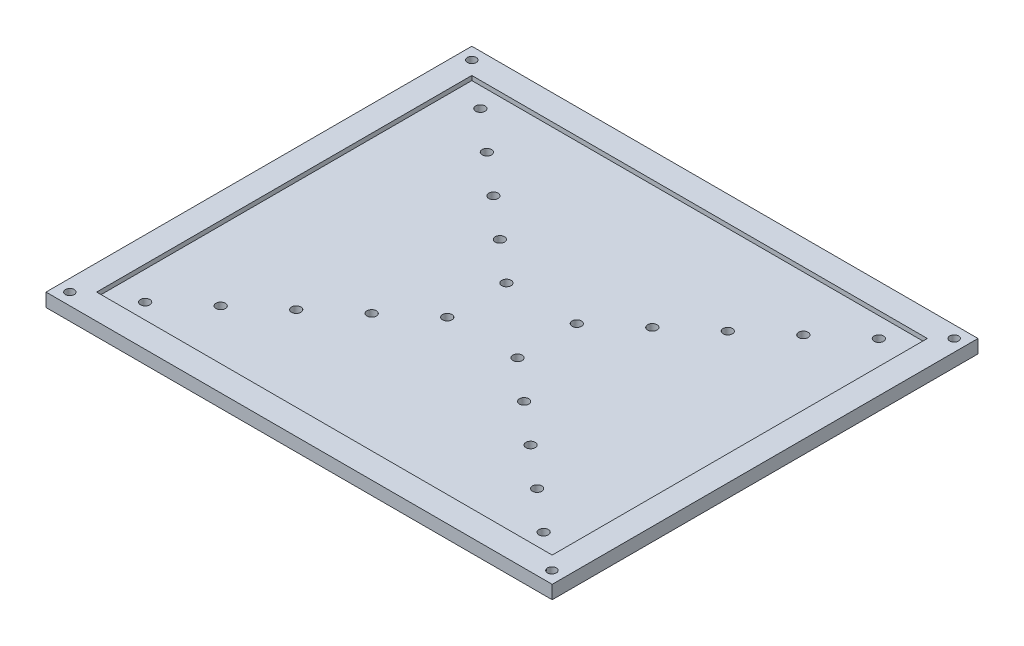
ISO-10303-21;
HEADER;
FILE_DESCRIPTION(('STEP AP214'),'2;1');
FILE_NAME('part.step','',(''),(''),'','','');
FILE_SCHEMA(('AUTOMOTIVE_DESIGN { 1 0 10303 214 1 1 1 1 }'));
ENDSEC;
DATA;
#1=APPLICATION_CONTEXT('core data for automotive mechanical design processes');
#2=APPLICATION_PROTOCOL_DEFINITION('international standard','automotive_design',2000,#1);
#3=PRODUCT_CONTEXT('',#1,'mechanical');
#4=PRODUCT('Part','Part','',(#3));
#5=PRODUCT_RELATED_PRODUCT_CATEGORY('part','',(#4));
#6=PRODUCT_DEFINITION_FORMATION('','',#4);
#7=PRODUCT_DEFINITION_CONTEXT('part definition',#1,'design');
#8=PRODUCT_DEFINITION('design','',#6,#7);
#9=PRODUCT_DEFINITION_SHAPE('','',#8);
#10=(LENGTH_UNIT() NAMED_UNIT(*) SI_UNIT(.MILLI.,.METRE.));
#11=(NAMED_UNIT(*) PLANE_ANGLE_UNIT() SI_UNIT($,.RADIAN.));
#12=(NAMED_UNIT(*) SI_UNIT($,.STERADIAN.) SOLID_ANGLE_UNIT());
#13=UNCERTAINTY_MEASURE_WITH_UNIT(LENGTH_MEASURE(1.E-05),#10,'distance_accuracy_value','');
#14=(GEOMETRIC_REPRESENTATION_CONTEXT(3) GLOBAL_UNCERTAINTY_ASSIGNED_CONTEXT((#13)) GLOBAL_UNIT_ASSIGNED_CONTEXT((#10,
#11,#12)) REPRESENTATION_CONTEXT('',''));
#15=CARTESIAN_POINT('',(0.,0.,0.));
#16=DIRECTION('',(0.,0.,1.));
#17=DIRECTION('',(1.,0.,0.));
#18=AXIS2_PLACEMENT_3D('',#15,#16,#17);
#19=CARTESIAN_POINT('',(-94.45,5.,-79.45));
#20=DIRECTION('',(1.,0.,0.));
#21=DIRECTION('',(0.,0.,-1.));
#22=AXIS2_PLACEMENT_3D('',#19,#20,#21);
#23=PLANE('',#22);
#24=DIRECTION('',(0.,0.,1.));
#25=VECTOR('',#24,1.);
#26=CARTESIAN_POINT('',(-94.45,0.,-79.45));
#27=LINE('',#26,#25);
#28=CARTESIAN_POINT('',(-94.45,0.,-79.45));
#29=VERTEX_POINT('',#28);
#30=CARTESIAN_POINT('',(-94.45,0.,79.45));
#31=VERTEX_POINT('',#30);
#32=EDGE_CURVE('E150',#29,#31,#27,.T.);
#33=ORIENTED_EDGE('',*,*,#32,.T.);
#34=DIRECTION('',(0.,-1.,0.));
#35=VECTOR('',#34,1.);
#36=CARTESIAN_POINT('',(-94.45,5.,79.45));
#37=LINE('',#36,#35);
#38=CARTESIAN_POINT('',(-94.45,5.,79.45));
#39=VERTEX_POINT('',#38);
#40=EDGE_CURVE('E11',#39,#31,#37,.T.);
#41=ORIENTED_EDGE('',*,*,#40,.F.);
#42=DIRECTION('',(0.,0.,1.));
#43=VECTOR('',#42,1.);
#44=CARTESIAN_POINT('',(-94.45,5.,-79.45));
#45=LINE('',#44,#43);
#46=CARTESIAN_POINT('',(-94.45,5.,-79.45));
#47=VERTEX_POINT('',#46);
#48=EDGE_CURVE('E154',#47,#39,#45,.T.);
#49=ORIENTED_EDGE('',*,*,#48,.F.);
#50=DIRECTION('',(0.,-1.,0.));
#51=VECTOR('',#50,1.);
#52=CARTESIAN_POINT('',(-94.45,5.,-79.45));
#53=LINE('',#52,#51);
#54=EDGE_CURVE('E160',#47,#29,#53,.T.);
#55=ORIENTED_EDGE('',*,*,#54,.T.);
#56=EDGE_LOOP('',(#33,#41,#49,#55));
#57=FACE_BOUND('',#56,.T.);
#58=ADVANCED_FACE('F36',(#57),#23,.F.);
#59=CARTESIAN_POINT('',(-94.45,5.,79.45));
#60=DIRECTION('',(0.,0.,-1.));
#61=DIRECTION('',(-1.,0.,0.));
#62=AXIS2_PLACEMENT_3D('',#59,#60,#61);
#63=PLANE('',#62);
#64=DIRECTION('',(1.,0.,0.));
#65=VECTOR('',#64,1.);
#66=CARTESIAN_POINT('',(-94.45,0.,79.45));
#67=LINE('',#66,#65);
#68=CARTESIAN_POINT('',(94.45,0.,79.45));
#69=VERTEX_POINT('',#68);
#70=EDGE_CURVE('E163',#31,#69,#67,.T.);
#71=ORIENTED_EDGE('',*,*,#70,.T.);
#72=DIRECTION('',(0.,-1.,0.));
#73=VECTOR('',#72,1.);
#74=CARTESIAN_POINT('',(94.45,5.,79.45));
#75=LINE('',#74,#73);
#76=CARTESIAN_POINT('',(94.45,5.,79.45));
#77=VERTEX_POINT('',#76);
#78=EDGE_CURVE('E44',#77,#69,#75,.T.);
#79=ORIENTED_EDGE('',*,*,#78,.F.);
#80=DIRECTION('',(1.,0.,0.));
#81=VECTOR('',#80,1.);
#82=CARTESIAN_POINT('',(-94.45,5.,79.45));
#83=LINE('',#82,#81);
#84=EDGE_CURVE('E89',#39,#77,#83,.T.);
#85=ORIENTED_EDGE('',*,*,#84,.F.);
#86=ORIENTED_EDGE('',*,*,#40,.T.);
#87=EDGE_LOOP('',(#71,#79,#85,#86));
#88=FACE_BOUND('',#87,.T.);
#89=ADVANCED_FACE('F358',(#88),#63,.F.);
#90=CARTESIAN_POINT('',(94.45,5.,-79.45));
#91=DIRECTION('',(-1.,0.,0.));
#92=DIRECTION('',(0.,0.,1.));
#93=AXIS2_PLACEMENT_3D('',#90,#91,#92);
#94=PLANE('',#93);
#95=DIRECTION('',(0.,0.,-1.));
#96=VECTOR('',#95,1.);
#97=CARTESIAN_POINT('',(94.45,0.,-79.45));
#98=LINE('',#97,#96);
#99=CARTESIAN_POINT('',(94.45,0.,-79.45));
#100=VERTEX_POINT('',#99);
#101=EDGE_CURVE('E165',#69,#100,#98,.T.);
#102=ORIENTED_EDGE('',*,*,#101,.T.);
#103=DIRECTION('',(0.,-1.,0.));
#104=VECTOR('',#103,1.);
#105=CARTESIAN_POINT('',(94.45,5.,-79.45));
#106=LINE('',#105,#104);
#107=CARTESIAN_POINT('',(94.45,5.,-79.45));
#108=VERTEX_POINT('',#107);
#109=EDGE_CURVE('E169',#108,#100,#106,.T.);
#110=ORIENTED_EDGE('',*,*,#109,.F.);
#111=DIRECTION('',(0.,0.,-1.));
#112=VECTOR('',#111,1.);
#113=CARTESIAN_POINT('',(94.45,5.,-79.45));
#114=LINE('',#113,#112);
#115=EDGE_CURVE('E157',#77,#108,#114,.T.);
#116=ORIENTED_EDGE('',*,*,#115,.F.);
#117=ORIENTED_EDGE('',*,*,#78,.T.);
#118=EDGE_LOOP('',(#102,#110,#116,#117));
#119=FACE_BOUND('',#118,.T.);
#120=ADVANCED_FACE('F357',(#119),#94,.F.);
#121=CARTESIAN_POINT('',(-94.45,5.,-79.45));
#122=DIRECTION('',(0.,0.,1.));
#123=DIRECTION('',(1.,0.,0.));
#124=AXIS2_PLACEMENT_3D('',#121,#122,#123);
#125=PLANE('',#124);
#126=DIRECTION('',(-1.,0.,0.));
#127=VECTOR('',#126,1.);
#128=CARTESIAN_POINT('',(-94.45,0.,-79.45));
#129=LINE('',#128,#127);
#130=EDGE_CURVE('E82',#100,#29,#129,.T.);
#131=ORIENTED_EDGE('',*,*,#130,.T.);
#132=ORIENTED_EDGE('',*,*,#54,.F.);
#133=DIRECTION('',(-1.,0.,0.));
#134=VECTOR('',#133,1.);
#135=CARTESIAN_POINT('',(-94.45,5.,-79.45));
#136=LINE('',#135,#134);
#137=EDGE_CURVE('E61',#108,#47,#136,.T.);
#138=ORIENTED_EDGE('',*,*,#137,.F.);
#139=ORIENTED_EDGE('',*,*,#109,.T.);
#140=EDGE_LOOP('',(#131,#132,#138,#139));
#141=FACE_BOUND('',#140,.T.);
#142=ADVANCED_FACE('F353',(#141),#125,.F.);
#143=CARTESIAN_POINT('',(0.,5.,0.));
#144=DIRECTION('',(0.,1.,0.));
#145=DIRECTION('',(0.,0.,1.));
#146=AXIS2_PLACEMENT_3D('',#143,#144,#145);
#147=PLANE('',#146);
#148=CARTESIAN_POINT('',(-90.,5.,75.));
#149=DIRECTION('',(0.,1.,0.));
#150=DIRECTION('',(0.,0.,1.));
#151=AXIS2_PLACEMENT_3D('',#148,#149,#150);
#152=CIRCLE('',#151,1.65);
#153=CARTESIAN_POINT('',(-90.,5.,76.65));
#154=VERTEX_POINT('',#153);
#155=EDGE_CURVE('E177',#154,#154,#152,.T.);
#156=ORIENTED_EDGE('',*,*,#155,.F.);
#157=EDGE_LOOP('',(#156));
#158=FACE_BOUND('',#157,.T.);
#159=CARTESIAN_POINT('',(89.9,5.,75.));
#160=DIRECTION('',(0.,1.,0.));
#161=DIRECTION('',(0.,0.,1.));
#162=AXIS2_PLACEMENT_3D('',#159,#160,#161);
#163=CIRCLE('',#162,1.65);
#164=CARTESIAN_POINT('',(89.9,5.,76.65));
#165=VERTEX_POINT('',#164);
#166=EDGE_CURVE('E193',#165,#165,#163,.T.);
#167=ORIENTED_EDGE('',*,*,#166,.F.);
#168=EDGE_LOOP('',(#167));
#169=FACE_BOUND('',#168,.T.);
#170=CARTESIAN_POINT('',(90.,5.,-75.));
#171=DIRECTION('',(0.,1.,0.));
#172=DIRECTION('',(0.,0.,1.));
#173=AXIS2_PLACEMENT_3D('',#170,#171,#172);
#174=CIRCLE('',#173,1.65);
#175=CARTESIAN_POINT('',(90.,5.,-73.35));
#176=VERTEX_POINT('',#175);
#177=EDGE_CURVE('E190',#176,#176,#174,.T.);
#178=ORIENTED_EDGE('',*,*,#177,.F.);
#179=EDGE_LOOP('',(#178));
#180=FACE_BOUND('',#179,.T.);
#181=CARTESIAN_POINT('',(-90.,5.,-75.));
#182=DIRECTION('',(0.,1.,0.));
#183=DIRECTION('',(0.,0.,1.));
#184=AXIS2_PLACEMENT_3D('',#181,#182,#183);
#185=CIRCLE('',#184,1.65);
#186=CARTESIAN_POINT('',(-90.,5.,-73.35));
#187=VERTEX_POINT('',#186);
#188=EDGE_CURVE('E137',#187,#187,#185,.T.);
#189=ORIENTED_EDGE('',*,*,#188,.F.);
#190=EDGE_LOOP('',(#189));
#191=FACE_BOUND('',#190,.T.);
#192=DIRECTION('',(0.,0.,1.));
#193=VECTOR('',#192,1.);
#194=CARTESIAN_POINT('',(-85.,5.,-70.));
#195=LINE('',#194,#193);
#196=CARTESIAN_POINT('',(-85.,5.,-70.));
#197=VERTEX_POINT('',#196);
#198=CARTESIAN_POINT('',(-85.,5.,70.));
#199=VERTEX_POINT('',#198);
#200=EDGE_CURVE('E52',#197,#199,#195,.T.);
#201=ORIENTED_EDGE('',*,*,#200,.F.);
#202=DIRECTION('',(-1.,0.,0.));
#203=VECTOR('',#202,1.);
#204=CARTESIAN_POINT('',(-85.,5.,-70.));
#205=LINE('',#204,#203);
#206=CARTESIAN_POINT('',(85.,5.,-70.));
#207=VERTEX_POINT('',#206);
#208=EDGE_CURVE('E131',#207,#197,#205,.T.);
#209=ORIENTED_EDGE('',*,*,#208,.F.);
#210=DIRECTION('',(0.,0.,-1.));
#211=VECTOR('',#210,1.);
#212=CARTESIAN_POINT('',(85.,5.,-70.));
#213=LINE('',#212,#211);
#214=CARTESIAN_POINT('',(85.,5.,70.));
#215=VERTEX_POINT('',#214);
#216=EDGE_CURVE('E134',#215,#207,#213,.T.);
#217=ORIENTED_EDGE('',*,*,#216,.F.);
#218=DIRECTION('',(1.,0.,0.));
#219=VECTOR('',#218,1.);
#220=CARTESIAN_POINT('',(-85.,5.,70.));
#221=LINE('',#220,#219);
#222=EDGE_CURVE('E143',#199,#215,#221,.T.);
#223=ORIENTED_EDGE('',*,*,#222,.F.);
#224=EDGE_LOOP('',(#201,#209,#217,#223));
#225=FACE_BOUND('',#224,.T.);
#226=ORIENTED_EDGE('',*,*,#48,.T.);
#227=ORIENTED_EDGE('',*,*,#84,.T.);
#228=ORIENTED_EDGE('',*,*,#115,.T.);
#229=ORIENTED_EDGE('',*,*,#137,.T.);
#230=EDGE_LOOP('',(#226,#227,#228,#229));
#231=FACE_BOUND('',#230,.T.);
#232=ADVANCED_FACE('F340',(#158,#169,#180,#191,#225,#231),#147,.T.);
#233=CARTESIAN_POINT('',(0.,0.,0.));
#234=DIRECTION('',(0.,1.,0.));
#235=DIRECTION('',(0.,0.,1.));
#236=AXIS2_PLACEMENT_3D('',#233,#234,#235);
#237=PLANE('',#236);
#238=CARTESIAN_POINT('',(-28.43683345006,0.,23.9206608534385));
#239=DIRECTION('',(0.,1.,0.));
#240=DIRECTION('',(0.,0.,1.));
#241=AXIS2_PLACEMENT_3D('',#238,#239,#240);
#242=CIRCLE('',#241,1.75);
#243=CARTESIAN_POINT('',(-28.43683345006,0.,25.6706608534385));
#244=VERTEX_POINT('',#243);
#245=EDGE_CURVE('E198',#244,#244,#242,.T.);
#246=ORIENTED_EDGE('',*,*,#245,.T.);
#247=EDGE_LOOP('',(#246));
#248=FACE_BOUND('',#247,.T.);
#249=CARTESIAN_POINT('',(-13.1316781711283,0.,11.0461813731725));
#250=DIRECTION('',(0.,1.,0.));
#251=DIRECTION('',(0.,0.,1.));
#252=AXIS2_PLACEMENT_3D('',#249,#250,#251);
#253=CIRCLE('',#252,1.75);
#254=CARTESIAN_POINT('',(-13.1316781711283,0.,12.7961813731725));
#255=VERTEX_POINT('',#254);
#256=EDGE_CURVE('E201',#255,#255,#253,.T.);
#257=ORIENTED_EDGE('',*,*,#256,.T.);
#258=EDGE_LOOP('',(#257));
#259=FACE_BOUND('',#258,.T.);
#260=CARTESIAN_POINT('',(13.1316781711283,0.,11.0461813731725));
#261=DIRECTION('',(0.,1.,0.));
#262=DIRECTION('',(0.,0.,1.));
#263=AXIS2_PLACEMENT_3D('',#260,#261,#262);
#264=CIRCLE('',#263,1.75);
#265=CARTESIAN_POINT('',(13.1316781711283,0.,12.7961813731725));
#266=VERTEX_POINT('',#265);
#267=EDGE_CURVE('E39',#266,#266,#264,.T.);
#268=ORIENTED_EDGE('',*,*,#267,.T.);
#269=EDGE_LOOP('',(#268));
#270=FACE_BOUND('',#269,.T.);
#271=CARTESIAN_POINT('',(28.43683345006,0.,23.9206608534385));
#272=DIRECTION('',(0.,1.,0.));
#273=DIRECTION('',(0.,0.,1.));
#274=AXIS2_PLACEMENT_3D('',#271,#272,#273);
#275=CIRCLE('',#274,1.75);
#276=CARTESIAN_POINT('',(28.43683345006,0.,25.6706608534385));
#277=VERTEX_POINT('',#276);
#278=EDGE_CURVE('E204',#277,#277,#275,.T.);
#279=ORIENTED_EDGE('',*,*,#278,.T.);
#280=EDGE_LOOP('',(#279));
#281=FACE_BOUND('',#280,.T.);
#282=CARTESIAN_POINT('',(43.7419887289917,0.,36.7951403337045));
#283=DIRECTION('',(0.,1.,0.));
#284=DIRECTION('',(0.,0.,1.));
#285=AXIS2_PLACEMENT_3D('',#282,#283,#284);
#286=CIRCLE('',#285,1.75);
#287=CARTESIAN_POINT('',(43.7419887289917,0.,38.5451403337045));
#288=VERTEX_POINT('',#287);
#289=EDGE_CURVE('E207',#288,#288,#286,.T.);
#290=ORIENTED_EDGE('',*,*,#289,.T.);
#291=EDGE_LOOP('',(#290));
#292=FACE_BOUND('',#291,.T.);
#293=CARTESIAN_POINT('',(59.0471440079233,0.,49.6696198139705));
#294=DIRECTION('',(0.,1.,0.));
#295=DIRECTION('',(0.,0.,1.));
#296=AXIS2_PLACEMENT_3D('',#293,#294,#295);
#297=CIRCLE('',#296,1.75);
#298=CARTESIAN_POINT('',(59.0471440079233,0.,51.4196198139705));
#299=VERTEX_POINT('',#298);
#300=EDGE_CURVE('E210',#299,#299,#297,.T.);
#301=ORIENTED_EDGE('',*,*,#300,.T.);
#302=EDGE_LOOP('',(#301));
#303=FACE_BOUND('',#302,.T.);
#304=CARTESIAN_POINT('',(74.352299286855,0.,62.5440992942364));
#305=DIRECTION('',(0.,1.,0.));
#306=DIRECTION('',(0.,0.,1.));
#307=AXIS2_PLACEMENT_3D('',#304,#305,#306);
#308=CIRCLE('',#307,1.75);
#309=CARTESIAN_POINT('',(74.352299286855,0.,64.2940992942364));
#310=VERTEX_POINT('',#309);
#311=EDGE_CURVE('E213',#310,#310,#308,.T.);
#312=ORIENTED_EDGE('',*,*,#311,.T.);
#313=EDGE_LOOP('',(#312));
#314=FACE_BOUND('',#313,.T.);
#315=CARTESIAN_POINT('',(74.352299286855,0.,-62.5440992942364));
#316=DIRECTION('',(0.,1.,0.));
#317=DIRECTION('',(0.,0.,1.));
#318=AXIS2_PLACEMENT_3D('',#315,#316,#317);
#319=CIRCLE('',#318,1.75);
#320=CARTESIAN_POINT('',(74.352299286855,0.,-60.7940992942364));
#321=VERTEX_POINT('',#320);
#322=EDGE_CURVE('E216',#321,#321,#319,.T.);
#323=ORIENTED_EDGE('',*,*,#322,.T.);
#324=EDGE_LOOP('',(#323));
#325=FACE_BOUND('',#324,.T.);
#326=CARTESIAN_POINT('',(59.0471440079233,0.,-49.6696198139705));
#327=DIRECTION('',(0.,1.,0.));
#328=DIRECTION('',(0.,0.,1.));
#329=AXIS2_PLACEMENT_3D('',#326,#327,#328);
#330=CIRCLE('',#329,1.75);
#331=CARTESIAN_POINT('',(59.0471440079233,0.,-47.9196198139705));
#332=VERTEX_POINT('',#331);
#333=EDGE_CURVE('E219',#332,#332,#330,.T.);
#334=ORIENTED_EDGE('',*,*,#333,.T.);
#335=EDGE_LOOP('',(#334));
#336=FACE_BOUND('',#335,.T.);
#337=CARTESIAN_POINT('',(43.7419887289917,0.,-36.7951403337045));
#338=DIRECTION('',(0.,1.,0.));
#339=DIRECTION('',(0.,0.,1.));
#340=AXIS2_PLACEMENT_3D('',#337,#338,#339);
#341=CIRCLE('',#340,1.75);
#342=CARTESIAN_POINT('',(43.7419887289917,0.,-35.0451403337045));
#343=VERTEX_POINT('',#342);
#344=EDGE_CURVE('E222',#343,#343,#341,.T.);
#345=ORIENTED_EDGE('',*,*,#344,.T.);
#346=EDGE_LOOP('',(#345));
#347=FACE_BOUND('',#346,.T.);
#348=CARTESIAN_POINT('',(28.43683345006,0.,-23.9206608534385));
#349=DIRECTION('',(0.,1.,0.));
#350=DIRECTION('',(0.,0.,1.));
#351=AXIS2_PLACEMENT_3D('',#348,#349,#350);
#352=CIRCLE('',#351,1.75);
#353=CARTESIAN_POINT('',(28.43683345006,0.,-22.1706608534385));
#354=VERTEX_POINT('',#353);
#355=EDGE_CURVE('E225',#354,#354,#352,.T.);
#356=ORIENTED_EDGE('',*,*,#355,.T.);
#357=EDGE_LOOP('',(#356));
#358=FACE_BOUND('',#357,.T.);
#359=CARTESIAN_POINT('',(13.1316781711283,0.,-11.0461813731725));
#360=DIRECTION('',(0.,1.,0.));
#361=DIRECTION('',(0.,0.,1.));
#362=AXIS2_PLACEMENT_3D('',#359,#360,#361);
#363=CIRCLE('',#362,1.75);
#364=CARTESIAN_POINT('',(13.1316781711283,0.,-9.2961813731725));
#365=VERTEX_POINT('',#364);
#366=EDGE_CURVE('E228',#365,#365,#363,.T.);
#367=ORIENTED_EDGE('',*,*,#366,.T.);
#368=EDGE_LOOP('',(#367));
#369=FACE_BOUND('',#368,.T.);
#370=CARTESIAN_POINT('',(-13.1316781711283,0.,-11.0461813731725));
#371=DIRECTION('',(0.,1.,0.));
#372=DIRECTION('',(0.,0.,1.));
#373=AXIS2_PLACEMENT_3D('',#370,#371,#372);
#374=CIRCLE('',#373,1.75);
#375=CARTESIAN_POINT('',(-13.1316781711283,0.,-9.2961813731725));
#376=VERTEX_POINT('',#375);
#377=EDGE_CURVE('E231',#376,#376,#374,.T.);
#378=ORIENTED_EDGE('',*,*,#377,.T.);
#379=EDGE_LOOP('',(#378));
#380=FACE_BOUND('',#379,.T.);
#381=CARTESIAN_POINT('',(-28.43683345006,0.,-23.9206608534385));
#382=DIRECTION('',(0.,1.,0.));
#383=DIRECTION('',(0.,0.,1.));
#384=AXIS2_PLACEMENT_3D('',#381,#382,#383);
#385=CIRCLE('',#384,1.75);
#386=CARTESIAN_POINT('',(-28.43683345006,0.,-22.1706608534385));
#387=VERTEX_POINT('',#386);
#388=EDGE_CURVE('E234',#387,#387,#385,.T.);
#389=ORIENTED_EDGE('',*,*,#388,.T.);
#390=EDGE_LOOP('',(#389));
#391=FACE_BOUND('',#390,.T.);
#392=CARTESIAN_POINT('',(-43.7419887289917,0.,-36.7951403337045));
#393=DIRECTION('',(0.,1.,0.));
#394=DIRECTION('',(0.,0.,1.));
#395=AXIS2_PLACEMENT_3D('',#392,#393,#394);
#396=CIRCLE('',#395,1.75);
#397=CARTESIAN_POINT('',(-43.7419887289917,0.,-35.0451403337045));
#398=VERTEX_POINT('',#397);
#399=EDGE_CURVE('E237',#398,#398,#396,.T.);
#400=ORIENTED_EDGE('',*,*,#399,.T.);
#401=EDGE_LOOP('',(#400));
#402=FACE_BOUND('',#401,.T.);
#403=CARTESIAN_POINT('',(-59.0471440079233,0.,-49.6696198139705));
#404=DIRECTION('',(0.,1.,0.));
#405=DIRECTION('',(0.,0.,1.));
#406=AXIS2_PLACEMENT_3D('',#403,#404,#405);
#407=CIRCLE('',#406,1.75);
#408=CARTESIAN_POINT('',(-59.0471440079233,0.,-47.9196198139705));
#409=VERTEX_POINT('',#408);
#410=EDGE_CURVE('E240',#409,#409,#407,.T.);
#411=ORIENTED_EDGE('',*,*,#410,.T.);
#412=EDGE_LOOP('',(#411));
#413=FACE_BOUND('',#412,.T.);
#414=CARTESIAN_POINT('',(-43.7419887289917,0.,36.7951403337045));
#415=DIRECTION('',(0.,1.,0.));
#416=DIRECTION('',(0.,0.,1.));
#417=AXIS2_PLACEMENT_3D('',#414,#415,#416);
#418=CIRCLE('',#417,1.75);
#419=CARTESIAN_POINT('',(-43.7419887289917,0.,38.5451403337045));
#420=VERTEX_POINT('',#419);
#421=EDGE_CURVE('E243',#420,#420,#418,.T.);
#422=ORIENTED_EDGE('',*,*,#421,.T.);
#423=EDGE_LOOP('',(#422));
#424=FACE_BOUND('',#423,.T.);
#425=CARTESIAN_POINT('',(-59.0471440079233,0.,49.6696198139705));
#426=DIRECTION('',(0.,1.,0.));
#427=DIRECTION('',(0.,0.,1.));
#428=AXIS2_PLACEMENT_3D('',#425,#426,#427);
#429=CIRCLE('',#428,1.75);
#430=CARTESIAN_POINT('',(-59.0471440079233,0.,51.4196198139705));
#431=VERTEX_POINT('',#430);
#432=EDGE_CURVE('E246',#431,#431,#429,.T.);
#433=ORIENTED_EDGE('',*,*,#432,.T.);
#434=EDGE_LOOP('',(#433));
#435=FACE_BOUND('',#434,.T.);
#436=CARTESIAN_POINT('',(-74.352299286855,0.,62.5440992942364));
#437=DIRECTION('',(0.,1.,0.));
#438=DIRECTION('',(0.,0.,1.));
#439=AXIS2_PLACEMENT_3D('',#436,#437,#438);
#440=CIRCLE('',#439,1.75);
#441=CARTESIAN_POINT('',(-74.352299286855,0.,64.2940992942364));
#442=VERTEX_POINT('',#441);
#443=EDGE_CURVE('E249',#442,#442,#440,.T.);
#444=ORIENTED_EDGE('',*,*,#443,.T.);
#445=EDGE_LOOP('',(#444));
#446=FACE_BOUND('',#445,.T.);
#447=CARTESIAN_POINT('',(-74.352299286855,0.,-62.5440992942364));
#448=DIRECTION('',(0.,1.,0.));
#449=DIRECTION('',(0.,0.,1.));
#450=AXIS2_PLACEMENT_3D('',#447,#448,#449);
#451=CIRCLE('',#450,1.75);
#452=CARTESIAN_POINT('',(-74.352299286855,0.,-60.7940992942364));
#453=VERTEX_POINT('',#452);
#454=EDGE_CURVE('E252',#453,#453,#451,.T.);
#455=ORIENTED_EDGE('',*,*,#454,.T.);
#456=EDGE_LOOP('',(#455));
#457=FACE_BOUND('',#456,.T.);
#458=CARTESIAN_POINT('',(-90.,0.,75.));
#459=DIRECTION('',(0.,1.,0.));
#460=DIRECTION('',(0.,0.,1.));
#461=AXIS2_PLACEMENT_3D('',#458,#459,#460);
#462=CIRCLE('',#461,1.65);
#463=CARTESIAN_POINT('',(-90.,0.,76.65));
#464=VERTEX_POINT('',#463);
#465=EDGE_CURVE('E179',#464,#464,#462,.T.);
#466=ORIENTED_EDGE('',*,*,#465,.T.);
#467=EDGE_LOOP('',(#466));
#468=FACE_BOUND('',#467,.T.);
#469=CARTESIAN_POINT('',(89.9,0.,75.));
#470=DIRECTION('',(0.,1.,0.));
#471=DIRECTION('',(0.,0.,1.));
#472=AXIS2_PLACEMENT_3D('',#469,#470,#471);
#473=CIRCLE('',#472,1.65);
#474=CARTESIAN_POINT('',(89.9,0.,76.65));
#475=VERTEX_POINT('',#474);
#476=EDGE_CURVE('E176',#475,#475,#473,.T.);
#477=ORIENTED_EDGE('',*,*,#476,.T.);
#478=EDGE_LOOP('',(#477));
#479=FACE_BOUND('',#478,.T.);
#480=CARTESIAN_POINT('',(90.,0.,-75.));
#481=DIRECTION('',(0.,1.,0.));
#482=DIRECTION('',(0.,0.,1.));
#483=AXIS2_PLACEMENT_3D('',#480,#481,#482);
#484=CIRCLE('',#483,1.65);
#485=CARTESIAN_POINT('',(90.,0.,-73.35));
#486=VERTEX_POINT('',#485);
#487=EDGE_CURVE('E173',#486,#486,#484,.T.);
#488=ORIENTED_EDGE('',*,*,#487,.T.);
#489=EDGE_LOOP('',(#488));
#490=FACE_BOUND('',#489,.T.);
#491=CARTESIAN_POINT('',(-90.,0.,-75.));
#492=DIRECTION('',(0.,1.,0.));
#493=DIRECTION('',(0.,0.,1.));
#494=AXIS2_PLACEMENT_3D('',#491,#492,#493);
#495=CIRCLE('',#494,1.65);
#496=CARTESIAN_POINT('',(-90.,0.,-73.35));
#497=VERTEX_POINT('',#496);
#498=EDGE_CURVE('E144',#497,#497,#495,.T.);
#499=ORIENTED_EDGE('',*,*,#498,.T.);
#500=EDGE_LOOP('',(#499));
#501=FACE_BOUND('',#500,.T.);
#502=ORIENTED_EDGE('',*,*,#32,.F.);
#503=ORIENTED_EDGE('',*,*,#130,.F.);
#504=ORIENTED_EDGE('',*,*,#101,.F.);
#505=ORIENTED_EDGE('',*,*,#70,.F.);
#506=EDGE_LOOP('',(#502,#503,#504,#505));
#507=FACE_BOUND('',#506,.T.);
#508=ADVANCED_FACE('F338',(#248,#259,#270,#281,#292,#303,#314,#325,#336,#347,#358,#369,#380,
#391,#402,#413,#424,#435,#446,#457,#468,#479,#490,#501,#507),#237,.F.);
#509=CARTESIAN_POINT('',(-85.,3.34,-70.));
#510=DIRECTION('',(-1.,0.,0.));
#511=DIRECTION('',(0.,0.,1.));
#512=AXIS2_PLACEMENT_3D('',#509,#510,#511);
#513=PLANE('',#512);
#514=ORIENTED_EDGE('',*,*,#200,.T.);
#515=DIRECTION('',(0.,1.,0.));
#516=VECTOR('',#515,1.);
#517=CARTESIAN_POINT('',(-85.,3.34,70.));
#518=LINE('',#517,#516);
#519=CARTESIAN_POINT('',(-85.,3.34,70.));
#520=VERTEX_POINT('',#519);
#521=EDGE_CURVE('E109',#520,#199,#518,.T.);
#522=ORIENTED_EDGE('',*,*,#521,.F.);
#523=DIRECTION('',(0.,0.,1.));
#524=VECTOR('',#523,1.);
#525=CARTESIAN_POINT('',(-85.,3.34,-70.));
#526=LINE('',#525,#524);
#527=CARTESIAN_POINT('',(-85.,3.34,-70.));
#528=VERTEX_POINT('',#527);
#529=EDGE_CURVE('E113',#528,#520,#526,.T.);
#530=ORIENTED_EDGE('',*,*,#529,.F.);
#531=DIRECTION('',(0.,1.,0.));
#532=VECTOR('',#531,1.);
#533=CARTESIAN_POINT('',(-85.,3.34,-70.));
#534=LINE('',#533,#532);
#535=EDGE_CURVE('E148',#528,#197,#534,.T.);
#536=ORIENTED_EDGE('',*,*,#535,.T.);
#537=EDGE_LOOP('',(#514,#522,#530,#536));
#538=FACE_BOUND('',#537,.T.);
#539=ADVANCED_FACE('F111',(#538),#513,.F.);
#540=CARTESIAN_POINT('',(-85.,3.34,-70.));
#541=DIRECTION('',(0.,0.,-1.));
#542=DIRECTION('',(-1.,0.,0.));
#543=AXIS2_PLACEMENT_3D('',#540,#541,#542);
#544=PLANE('',#543);
#545=ORIENTED_EDGE('',*,*,#208,.T.);
#546=ORIENTED_EDGE('',*,*,#535,.F.);
#547=DIRECTION('',(-1.,0.,0.));
#548=VECTOR('',#547,1.);
#549=CARTESIAN_POINT('',(-85.,3.34,-70.));
#550=LINE('',#549,#548);
#551=CARTESIAN_POINT('',(85.,3.34,-70.));
#552=VERTEX_POINT('',#551);
#553=EDGE_CURVE('E119',#552,#528,#550,.T.);
#554=ORIENTED_EDGE('',*,*,#553,.F.);
#555=DIRECTION('',(0.,1.,0.));
#556=VECTOR('',#555,1.);
#557=CARTESIAN_POINT('',(85.,3.34,-70.));
#558=LINE('',#557,#556);
#559=EDGE_CURVE('E151',#552,#207,#558,.T.);
#560=ORIENTED_EDGE('',*,*,#559,.T.);
#561=EDGE_LOOP('',(#545,#546,#554,#560));
#562=FACE_BOUND('',#561,.T.);
#563=ADVANCED_FACE('F373',(#562),#544,.F.);
#564=CARTESIAN_POINT('',(85.,3.34,-70.));
#565=DIRECTION('',(1.,0.,0.));
#566=DIRECTION('',(0.,0.,-1.));
#567=AXIS2_PLACEMENT_3D('',#564,#565,#566);
#568=PLANE('',#567);
#569=ORIENTED_EDGE('',*,*,#216,.T.);
#570=ORIENTED_EDGE('',*,*,#559,.F.);
#571=DIRECTION('',(0.,0.,-1.));
#572=VECTOR('',#571,1.);
#573=CARTESIAN_POINT('',(85.,3.34,-70.));
#574=LINE('',#573,#572);
#575=CARTESIAN_POINT('',(85.,3.34,70.));
#576=VERTEX_POINT('',#575);
#577=EDGE_CURVE('E127',#576,#552,#574,.T.);
#578=ORIENTED_EDGE('',*,*,#577,.F.);
#579=DIRECTION('',(0.,1.,0.));
#580=VECTOR('',#579,1.);
#581=CARTESIAN_POINT('',(85.,3.34,70.));
#582=LINE('',#581,#580);
#583=EDGE_CURVE('E118',#576,#215,#582,.T.);
#584=ORIENTED_EDGE('',*,*,#583,.T.);
#585=EDGE_LOOP('',(#569,#570,#578,#584));
#586=FACE_BOUND('',#585,.T.);
#587=ADVANCED_FACE('F376',(#586),#568,.F.);
#588=CARTESIAN_POINT('',(-85.,3.34,70.));
#589=DIRECTION('',(0.,0.,1.));
#590=DIRECTION('',(1.,0.,0.));
#591=AXIS2_PLACEMENT_3D('',#588,#589,#590);
#592=PLANE('',#591);
#593=ORIENTED_EDGE('',*,*,#222,.T.);
#594=ORIENTED_EDGE('',*,*,#583,.F.);
#595=DIRECTION('',(1.,0.,0.));
#596=VECTOR('',#595,1.);
#597=CARTESIAN_POINT('',(-85.,3.34,70.));
#598=LINE('',#597,#596);
#599=EDGE_CURVE('E122',#520,#576,#598,.T.);
#600=ORIENTED_EDGE('',*,*,#599,.F.);
#601=ORIENTED_EDGE('',*,*,#521,.T.);
#602=EDGE_LOOP('',(#593,#594,#600,#601));
#603=FACE_BOUND('',#602,.T.);
#604=ADVANCED_FACE('F123',(#603),#592,.F.);
#605=CARTESIAN_POINT('',(0.,3.34,0.));
#606=DIRECTION('',(0.,1.,0.));
#607=DIRECTION('',(0.,0.,1.));
#608=AXIS2_PLACEMENT_3D('',#605,#606,#607);
#609=PLANE('',#608);
#610=CARTESIAN_POINT('',(13.1316781711283,3.34,11.0461813731725));
#611=DIRECTION('',(0.,1.,0.));
#612=DIRECTION('',(0.,0.,1.));
#613=AXIS2_PLACEMENT_3D('',#610,#611,#612);
#614=CIRCLE('',#613,1.75);
#615=CARTESIAN_POINT('',(13.1316781711283,3.34,12.7961813731725));
#616=VERTEX_POINT('',#615);
#617=EDGE_CURVE('E290',#616,#616,#614,.T.);
#618=ORIENTED_EDGE('',*,*,#617,.F.);
#619=EDGE_LOOP('',(#618));
#620=FACE_BOUND('',#619,.T.);
#621=CARTESIAN_POINT('',(-28.43683345006,3.34,23.9206608534385));
#622=DIRECTION('',(0.,1.,0.));
#623=DIRECTION('',(0.,0.,-1.));
#624=AXIS2_PLACEMENT_3D('',#621,#622,#623);
#625=CIRCLE('',#624,1.75);
#626=CARTESIAN_POINT('',(-28.43683345006,3.34,22.1706608534385));
#627=VERTEX_POINT('',#626);
#628=EDGE_CURVE('E283',#627,#627,#625,.T.);
#629=ORIENTED_EDGE('',*,*,#628,.F.);
#630=EDGE_LOOP('',(#629));
#631=FACE_BOUND('',#630,.T.);
#632=CARTESIAN_POINT('',(-13.1316781711283,3.34,11.0461813731725));
#633=DIRECTION('',(0.,1.,0.));
#634=DIRECTION('',(0.,0.,-1.));
#635=AXIS2_PLACEMENT_3D('',#632,#633,#634);
#636=CIRCLE('',#635,1.75);
#637=CARTESIAN_POINT('',(-13.1316781711283,3.34,9.2961813731725));
#638=VERTEX_POINT('',#637);
#639=EDGE_CURVE('E286',#638,#638,#636,.T.);
#640=ORIENTED_EDGE('',*,*,#639,.F.);
#641=EDGE_LOOP('',(#640));
#642=FACE_BOUND('',#641,.T.);
#643=CARTESIAN_POINT('',(28.43683345006,3.34,23.9206608534385));
#644=DIRECTION('',(0.,1.,0.));
#645=DIRECTION('',(0.,0.,1.));
#646=AXIS2_PLACEMENT_3D('',#643,#644,#645);
#647=CIRCLE('',#646,1.75);
#648=CARTESIAN_POINT('',(28.43683345006,3.34,25.6706608534385));
#649=VERTEX_POINT('',#648);
#650=EDGE_CURVE('E293',#649,#649,#647,.T.);
#651=ORIENTED_EDGE('',*,*,#650,.F.);
#652=EDGE_LOOP('',(#651));
#653=FACE_BOUND('',#652,.T.);
#654=CARTESIAN_POINT('',(43.7419887289917,3.34,36.7951403337045));
#655=DIRECTION('',(0.,1.,0.));
#656=DIRECTION('',(0.,0.,1.));
#657=AXIS2_PLACEMENT_3D('',#654,#655,#656);
#658=CIRCLE('',#657,1.75);
#659=CARTESIAN_POINT('',(43.7419887289917,3.34,38.5451403337045));
#660=VERTEX_POINT('',#659);
#661=EDGE_CURVE('E296',#660,#660,#658,.T.);
#662=ORIENTED_EDGE('',*,*,#661,.F.);
#663=EDGE_LOOP('',(#662));
#664=FACE_BOUND('',#663,.T.);
#665=CARTESIAN_POINT('',(59.0471440079233,3.34,49.6696198139705));
#666=DIRECTION('',(0.,1.,0.));
#667=DIRECTION('',(0.,0.,1.));
#668=AXIS2_PLACEMENT_3D('',#665,#666,#667);
#669=CIRCLE('',#668,1.75);
#670=CARTESIAN_POINT('',(59.0471440079233,3.34,51.4196198139705));
#671=VERTEX_POINT('',#670);
#672=EDGE_CURVE('E299',#671,#671,#669,.T.);
#673=ORIENTED_EDGE('',*,*,#672,.F.);
#674=EDGE_LOOP('',(#673));
#675=FACE_BOUND('',#674,.T.);
#676=CARTESIAN_POINT('',(74.352299286855,3.34,62.5440992942364));
#677=DIRECTION('',(0.,1.,0.));
#678=DIRECTION('',(0.,0.,1.));
#679=AXIS2_PLACEMENT_3D('',#676,#677,#678);
#680=CIRCLE('',#679,1.75);
#681=CARTESIAN_POINT('',(74.352299286855,3.34,64.2940992942364));
#682=VERTEX_POINT('',#681);
#683=EDGE_CURVE('E302',#682,#682,#680,.T.);
#684=ORIENTED_EDGE('',*,*,#683,.F.);
#685=EDGE_LOOP('',(#684));
#686=FACE_BOUND('',#685,.T.);
#687=CARTESIAN_POINT('',(74.352299286855,3.34,-62.5440992942364));
#688=DIRECTION('',(0.,1.,0.));
#689=DIRECTION('',(0.,0.,-1.));
#690=AXIS2_PLACEMENT_3D('',#687,#688,#689);
#691=CIRCLE('',#690,1.75);
#692=CARTESIAN_POINT('',(74.352299286855,3.34,-64.2940992942364));
#693=VERTEX_POINT('',#692);
#694=EDGE_CURVE('E263',#693,#693,#691,.T.);
#695=ORIENTED_EDGE('',*,*,#694,.F.);
#696=EDGE_LOOP('',(#695));
#697=FACE_BOUND('',#696,.T.);
#698=CARTESIAN_POINT('',(59.0471440079233,3.34,-49.6696198139705));
#699=DIRECTION('',(0.,1.,0.));
#700=DIRECTION('',(0.,0.,-1.));
#701=AXIS2_PLACEMENT_3D('',#698,#699,#700);
#702=CIRCLE('',#701,1.75);
#703=CARTESIAN_POINT('',(59.0471440079233,3.34,-51.4196198139705));
#704=VERTEX_POINT('',#703);
#705=EDGE_CURVE('E259',#704,#704,#702,.T.);
#706=ORIENTED_EDGE('',*,*,#705,.F.);
#707=EDGE_LOOP('',(#706));
#708=FACE_BOUND('',#707,.T.);
#709=CARTESIAN_POINT('',(43.7419887289917,3.34,-36.7951403337045));
#710=DIRECTION('',(0.,1.,0.));
#711=DIRECTION('',(0.,0.,-1.));
#712=AXIS2_PLACEMENT_3D('',#709,#710,#711);
#713=CIRCLE('',#712,1.75);
#714=CARTESIAN_POINT('',(43.7419887289917,3.34,-38.5451403337045));
#715=VERTEX_POINT('',#714);
#716=EDGE_CURVE('E262',#715,#715,#713,.T.);
#717=ORIENTED_EDGE('',*,*,#716,.F.);
#718=EDGE_LOOP('',(#717));
#719=FACE_BOUND('',#718,.T.);
#720=CARTESIAN_POINT('',(28.43683345006,3.34,-23.9206608534385));
#721=DIRECTION('',(0.,1.,0.));
#722=DIRECTION('',(0.,0.,-1.));
#723=AXIS2_PLACEMENT_3D('',#720,#721,#722);
#724=CIRCLE('',#723,1.75);
#725=CARTESIAN_POINT('',(28.43683345006,3.34,-25.6706608534385));
#726=VERTEX_POINT('',#725);
#727=EDGE_CURVE('E266',#726,#726,#724,.T.);
#728=ORIENTED_EDGE('',*,*,#727,.F.);
#729=EDGE_LOOP('',(#728));
#730=FACE_BOUND('',#729,.T.);
#731=CARTESIAN_POINT('',(13.1316781711283,3.34,-11.0461813731725));
#732=DIRECTION('',(0.,1.,0.));
#733=DIRECTION('',(0.,0.,-1.));
#734=AXIS2_PLACEMENT_3D('',#731,#732,#733);
#735=CIRCLE('',#734,1.75);
#736=CARTESIAN_POINT('',(13.1316781711283,3.34,-12.7961813731725));
#737=VERTEX_POINT('',#736);
#738=EDGE_CURVE('E269',#737,#737,#735,.T.);
#739=ORIENTED_EDGE('',*,*,#738,.F.);
#740=EDGE_LOOP('',(#739));
#741=FACE_BOUND('',#740,.T.);
#742=CARTESIAN_POINT('',(-13.1316781711283,3.34,-11.0461813731725));
#743=DIRECTION('',(0.,1.,0.));
#744=DIRECTION('',(0.,0.,1.));
#745=AXIS2_PLACEMENT_3D('',#742,#743,#744);
#746=CIRCLE('',#745,1.75);
#747=CARTESIAN_POINT('',(-13.1316781711283,3.34,-9.2961813731725));
#748=VERTEX_POINT('',#747);
#749=EDGE_CURVE('E272',#748,#748,#746,.T.);
#750=ORIENTED_EDGE('',*,*,#749,.F.);
#751=EDGE_LOOP('',(#750));
#752=FACE_BOUND('',#751,.T.);
#753=CARTESIAN_POINT('',(-28.43683345006,3.34,-23.9206608534385));
#754=DIRECTION('',(0.,1.,0.));
#755=DIRECTION('',(0.,0.,1.));
#756=AXIS2_PLACEMENT_3D('',#753,#754,#755);
#757=CIRCLE('',#756,1.75);
#758=CARTESIAN_POINT('',(-28.43683345006,3.34,-22.1706608534385));
#759=VERTEX_POINT('',#758);
#760=EDGE_CURVE('E275',#759,#759,#757,.T.);
#761=ORIENTED_EDGE('',*,*,#760,.F.);
#762=EDGE_LOOP('',(#761));
#763=FACE_BOUND('',#762,.T.);
#764=CARTESIAN_POINT('',(-43.7419887289917,3.34,-36.7951403337045));
#765=DIRECTION('',(0.,1.,0.));
#766=DIRECTION('',(0.,0.,1.));
#767=AXIS2_PLACEMENT_3D('',#764,#765,#766);
#768=CIRCLE('',#767,1.75);
#769=CARTESIAN_POINT('',(-43.7419887289917,3.34,-35.0451403337045));
#770=VERTEX_POINT('',#769);
#771=EDGE_CURVE('E278',#770,#770,#768,.T.);
#772=ORIENTED_EDGE('',*,*,#771,.F.);
#773=EDGE_LOOP('',(#772));
#774=FACE_BOUND('',#773,.T.);
#775=CARTESIAN_POINT('',(-59.0471440079233,3.34,-49.6696198139705));
#776=DIRECTION('',(0.,1.,0.));
#777=DIRECTION('',(0.,0.,1.));
#778=AXIS2_PLACEMENT_3D('',#775,#776,#777);
#779=CIRCLE('',#778,1.75);
#780=CARTESIAN_POINT('',(-59.0471440079233,3.34,-47.9196198139705));
#781=VERTEX_POINT('',#780);
#782=EDGE_CURVE('E258',#781,#781,#779,.T.);
#783=ORIENTED_EDGE('',*,*,#782,.F.);
#784=EDGE_LOOP('',(#783));
#785=FACE_BOUND('',#784,.T.);
#786=CARTESIAN_POINT('',(-43.7419887289917,3.34,36.7951403337045));
#787=DIRECTION('',(0.,1.,0.));
#788=DIRECTION('',(0.,0.,-1.));
#789=AXIS2_PLACEMENT_3D('',#786,#787,#788);
#790=CIRCLE('',#789,1.75);
#791=CARTESIAN_POINT('',(-43.7419887289917,3.34,35.0451403337045));
#792=VERTEX_POINT('',#791);
#793=EDGE_CURVE('E287',#792,#792,#790,.T.);
#794=ORIENTED_EDGE('',*,*,#793,.F.);
#795=EDGE_LOOP('',(#794));
#796=FACE_BOUND('',#795,.T.);
#797=CARTESIAN_POINT('',(-59.0471440079233,3.34,49.6696198139705));
#798=DIRECTION('',(0.,1.,0.));
#799=DIRECTION('',(0.,0.,-1.));
#800=AXIS2_PLACEMENT_3D('',#797,#798,#799);
#801=CIRCLE('',#800,1.75);
#802=CARTESIAN_POINT('',(-59.0471440079233,3.34,47.9196198139705));
#803=VERTEX_POINT('',#802);
#804=EDGE_CURVE('E310',#803,#803,#801,.T.);
#805=ORIENTED_EDGE('',*,*,#804,.F.);
#806=EDGE_LOOP('',(#805));
#807=FACE_BOUND('',#806,.T.);
#808=CARTESIAN_POINT('',(-74.352299286855,3.34,62.5440992942364));
#809=DIRECTION('',(0.,1.,0.));
#810=DIRECTION('',(0.,0.,-1.));
#811=AXIS2_PLACEMENT_3D('',#808,#809,#810);
#812=CIRCLE('',#811,1.75);
#813=CARTESIAN_POINT('',(-74.352299286855,3.34,60.7940992942364));
#814=VERTEX_POINT('',#813);
#815=EDGE_CURVE('E307',#814,#814,#812,.T.);
#816=ORIENTED_EDGE('',*,*,#815,.F.);
#817=EDGE_LOOP('',(#816));
#818=FACE_BOUND('',#817,.T.);
#819=CARTESIAN_POINT('',(-74.352299286855,3.34,-62.5440992942364));
#820=DIRECTION('',(0.,1.,0.));
#821=DIRECTION('',(0.,0.,1.));
#822=AXIS2_PLACEMENT_3D('',#819,#820,#821);
#823=CIRCLE('',#822,1.75);
#824=CARTESIAN_POINT('',(-74.352299286855,3.34,-60.7940992942364));
#825=VERTEX_POINT('',#824);
#826=EDGE_CURVE('E255',#825,#825,#823,.T.);
#827=ORIENTED_EDGE('',*,*,#826,.F.);
#828=EDGE_LOOP('',(#827));
#829=FACE_BOUND('',#828,.T.);
#830=ORIENTED_EDGE('',*,*,#529,.T.);
#831=ORIENTED_EDGE('',*,*,#599,.T.);
#832=ORIENTED_EDGE('',*,*,#577,.T.);
#833=ORIENTED_EDGE('',*,*,#553,.T.);
#834=EDGE_LOOP('',(#830,#831,#832,#833));
#835=FACE_BOUND('',#834,.T.);
#836=ADVANCED_FACE('F129',(#620,#631,#642,#653,#664,#675,#686,#697,#708,#719,#730,#741,#752,
#763,#774,#785,#796,#807,#818,#829,#835),#609,.T.);
#837=CARTESIAN_POINT('',(-90.,0.,-75.));
#838=DIRECTION('',(0.,1.,0.));
#839=DIRECTION('',(0.,0.,1.));
#840=AXIS2_PLACEMENT_3D('',#837,#838,#839);
#841=CYLINDRICAL_SURFACE('',#840,1.65);
#842=ORIENTED_EDGE('',*,*,#498,.F.);
#843=EDGE_LOOP('',(#842));
#844=FACE_BOUND('',#843,.T.);
#845=ORIENTED_EDGE('',*,*,#188,.T.);
#846=EDGE_LOOP('',(#845));
#847=FACE_BOUND('',#846,.T.);
#848=ADVANCED_FACE('F321',(#844,#847),#841,.F.);
#849=CARTESIAN_POINT('',(90.,-5.,-75.));
#850=DIRECTION('',(0.,1.,0.));
#851=DIRECTION('',(0.,0.,1.));
#852=AXIS2_PLACEMENT_3D('',#849,#850,#851);
#853=CYLINDRICAL_SURFACE('',#852,1.65);
#854=ORIENTED_EDGE('',*,*,#177,.T.);
#855=EDGE_LOOP('',(#854));
#856=FACE_BOUND('',#855,.T.);
#857=ORIENTED_EDGE('',*,*,#487,.F.);
#858=EDGE_LOOP('',(#857));
#859=FACE_BOUND('',#858,.T.);
#860=ADVANCED_FACE('F385',(#856,#859),#853,.F.);
#861=CARTESIAN_POINT('',(89.9,-5.,75.));
#862=DIRECTION('',(0.,1.,0.));
#863=DIRECTION('',(0.,0.,1.));
#864=AXIS2_PLACEMENT_3D('',#861,#862,#863);
#865=CYLINDRICAL_SURFACE('',#864,1.65);
#866=ORIENTED_EDGE('',*,*,#166,.T.);
#867=EDGE_LOOP('',(#866));
#868=FACE_BOUND('',#867,.T.);
#869=ORIENTED_EDGE('',*,*,#476,.F.);
#870=EDGE_LOOP('',(#869));
#871=FACE_BOUND('',#870,.T.);
#872=ADVANCED_FACE('F389',(#868,#871),#865,.F.);
#873=CARTESIAN_POINT('',(-90.,-5.,75.));
#874=DIRECTION('',(0.,1.,0.));
#875=DIRECTION('',(0.,0.,1.));
#876=AXIS2_PLACEMENT_3D('',#873,#874,#875);
#877=CYLINDRICAL_SURFACE('',#876,1.65);
#878=ORIENTED_EDGE('',*,*,#155,.T.);
#879=EDGE_LOOP('',(#878));
#880=FACE_BOUND('',#879,.T.);
#881=ORIENTED_EDGE('',*,*,#465,.F.);
#882=EDGE_LOOP('',(#881));
#883=FACE_BOUND('',#882,.T.);
#884=ADVANCED_FACE('F334',(#880,#883),#877,.F.);
#885=CARTESIAN_POINT('',(-74.352299286855,-6.66,-62.5440992942364));
#886=DIRECTION('',(0.,1.,0.));
#887=DIRECTION('',(0.,0.,1.));
#888=AXIS2_PLACEMENT_3D('',#885,#886,#887);
#889=CYLINDRICAL_SURFACE('',#888,1.75);
#890=ORIENTED_EDGE('',*,*,#826,.T.);
#891=EDGE_LOOP('',(#890));
#892=FACE_BOUND('',#891,.T.);
#893=ORIENTED_EDGE('',*,*,#454,.F.);
#894=EDGE_LOOP('',(#893));
#895=FACE_BOUND('',#894,.T.);
#896=ADVANCED_FACE('F330',(#892,#895),#889,.F.);
#897=CARTESIAN_POINT('',(-74.352299286855,-6.66,62.5440992942364));
#898=DIRECTION('',(0.,1.,0.));
#899=DIRECTION('',(0.,0.,1.));
#900=AXIS2_PLACEMENT_3D('',#897,#898,#899);
#901=CYLINDRICAL_SURFACE('',#900,1.75);
#902=ORIENTED_EDGE('',*,*,#815,.T.);
#903=EDGE_LOOP('',(#902));
#904=FACE_BOUND('',#903,.T.);
#905=ORIENTED_EDGE('',*,*,#443,.F.);
#906=EDGE_LOOP('',(#905));
#907=FACE_BOUND('',#906,.T.);
#908=ADVANCED_FACE('F333',(#904,#907),#901,.F.);
#909=CARTESIAN_POINT('',(-59.0471440079233,-6.66,49.6696198139705));
#910=DIRECTION('',(0.,1.,0.));
#911=DIRECTION('',(0.,0.,1.));
#912=AXIS2_PLACEMENT_3D('',#909,#910,#911);
#913=CYLINDRICAL_SURFACE('',#912,1.75);
#914=ORIENTED_EDGE('',*,*,#804,.T.);
#915=EDGE_LOOP('',(#914));
#916=FACE_BOUND('',#915,.T.);
#917=ORIENTED_EDGE('',*,*,#432,.F.);
#918=EDGE_LOOP('',(#917));
#919=FACE_BOUND('',#918,.T.);
#920=ADVANCED_FACE('F463',(#916,#919),#913,.F.);
#921=CARTESIAN_POINT('',(-43.7419887289917,-6.66,36.7951403337045));
#922=DIRECTION('',(0.,1.,0.));
#923=DIRECTION('',(0.,0.,1.));
#924=AXIS2_PLACEMENT_3D('',#921,#922,#923);
#925=CYLINDRICAL_SURFACE('',#924,1.75);
#926=ORIENTED_EDGE('',*,*,#793,.T.);
#927=EDGE_LOOP('',(#926));
#928=FACE_BOUND('',#927,.T.);
#929=ORIENTED_EDGE('',*,*,#421,.F.);
#930=EDGE_LOOP('',(#929));
#931=FACE_BOUND('',#930,.T.);
#932=ADVANCED_FACE('F316',(#928,#931),#925,.F.);
#933=CARTESIAN_POINT('',(-59.0471440079233,-6.66,-49.6696198139705));
#934=DIRECTION('',(0.,1.,0.));
#935=DIRECTION('',(0.,0.,1.));
#936=AXIS2_PLACEMENT_3D('',#933,#934,#935);
#937=CYLINDRICAL_SURFACE('',#936,1.75);
#938=ORIENTED_EDGE('',*,*,#782,.T.);
#939=EDGE_LOOP('',(#938));
#940=FACE_BOUND('',#939,.T.);
#941=ORIENTED_EDGE('',*,*,#410,.F.);
#942=EDGE_LOOP('',(#941));
#943=FACE_BOUND('',#942,.T.);
#944=ADVANCED_FACE('F425',(#940,#943),#937,.F.);
#945=CARTESIAN_POINT('',(-43.7419887289917,-6.66,-36.7951403337045));
#946=DIRECTION('',(0.,1.,0.));
#947=DIRECTION('',(0.,0.,1.));
#948=AXIS2_PLACEMENT_3D('',#945,#946,#947);
#949=CYLINDRICAL_SURFACE('',#948,1.75);
#950=ORIENTED_EDGE('',*,*,#771,.T.);
#951=EDGE_LOOP('',(#950));
#952=FACE_BOUND('',#951,.T.);
#953=ORIENTED_EDGE('',*,*,#399,.F.);
#954=EDGE_LOOP('',(#953));
#955=FACE_BOUND('',#954,.T.);
#956=ADVANCED_FACE('F421',(#952,#955),#949,.F.);
#957=CARTESIAN_POINT('',(-28.43683345006,-6.66,-23.9206608534385));
#958=DIRECTION('',(0.,1.,0.));
#959=DIRECTION('',(0.,0.,1.));
#960=AXIS2_PLACEMENT_3D('',#957,#958,#959);
#961=CYLINDRICAL_SURFACE('',#960,1.75);
#962=ORIENTED_EDGE('',*,*,#760,.T.);
#963=EDGE_LOOP('',(#962));
#964=FACE_BOUND('',#963,.T.);
#965=ORIENTED_EDGE('',*,*,#388,.F.);
#966=EDGE_LOOP('',(#965));
#967=FACE_BOUND('',#966,.T.);
#968=ADVANCED_FACE('F417',(#964,#967),#961,.F.);
#969=CARTESIAN_POINT('',(-13.1316781711283,-6.66,-11.0461813731725));
#970=DIRECTION('',(0.,1.,0.));
#971=DIRECTION('',(0.,0.,1.));
#972=AXIS2_PLACEMENT_3D('',#969,#970,#971);
#973=CYLINDRICAL_SURFACE('',#972,1.75);
#974=ORIENTED_EDGE('',*,*,#749,.T.);
#975=EDGE_LOOP('',(#974));
#976=FACE_BOUND('',#975,.T.);
#977=ORIENTED_EDGE('',*,*,#377,.F.);
#978=EDGE_LOOP('',(#977));
#979=FACE_BOUND('',#978,.T.);
#980=ADVANCED_FACE('F413',(#976,#979),#973,.F.);
#981=CARTESIAN_POINT('',(13.1316781711283,-6.66,-11.0461813731725));
#982=DIRECTION('',(0.,1.,0.));
#983=DIRECTION('',(0.,0.,1.));
#984=AXIS2_PLACEMENT_3D('',#981,#982,#983);
#985=CYLINDRICAL_SURFACE('',#984,1.75);
#986=ORIENTED_EDGE('',*,*,#738,.T.);
#987=EDGE_LOOP('',(#986));
#988=FACE_BOUND('',#987,.T.);
#989=ORIENTED_EDGE('',*,*,#366,.F.);
#990=EDGE_LOOP('',(#989));
#991=FACE_BOUND('',#990,.T.);
#992=ADVANCED_FACE('F409',(#988,#991),#985,.F.);
#993=CARTESIAN_POINT('',(28.43683345006,-6.66,-23.9206608534385));
#994=DIRECTION('',(0.,1.,0.));
#995=DIRECTION('',(0.,0.,1.));
#996=AXIS2_PLACEMENT_3D('',#993,#994,#995);
#997=CYLINDRICAL_SURFACE('',#996,1.75);
#998=ORIENTED_EDGE('',*,*,#727,.T.);
#999=EDGE_LOOP('',(#998));
#1000=FACE_BOUND('',#999,.T.);
#1001=ORIENTED_EDGE('',*,*,#355,.F.);
#1002=EDGE_LOOP('',(#1001));
#1003=FACE_BOUND('',#1002,.T.);
#1004=ADVANCED_FACE('F405',(#1000,#1003),#997,.F.);
#1005=CARTESIAN_POINT('',(43.7419887289917,-6.66,-36.7951403337045));
#1006=DIRECTION('',(0.,1.,0.));
#1007=DIRECTION('',(0.,0.,1.));
#1008=AXIS2_PLACEMENT_3D('',#1005,#1006,#1007);
#1009=CYLINDRICAL_SURFACE('',#1008,1.75);
#1010=ORIENTED_EDGE('',*,*,#716,.T.);
#1011=EDGE_LOOP('',(#1010));
#1012=FACE_BOUND('',#1011,.T.);
#1013=ORIENTED_EDGE('',*,*,#344,.F.);
#1014=EDGE_LOOP('',(#1013));
#1015=FACE_BOUND('',#1014,.T.);
#1016=ADVANCED_FACE('F401',(#1012,#1015),#1009,.F.);
#1017=CARTESIAN_POINT('',(59.0471440079233,-6.66,-49.6696198139705));
#1018=DIRECTION('',(0.,1.,0.));
#1019=DIRECTION('',(0.,0.,1.));
#1020=AXIS2_PLACEMENT_3D('',#1017,#1018,#1019);
#1021=CYLINDRICAL_SURFACE('',#1020,1.75);
#1022=ORIENTED_EDGE('',*,*,#705,.T.);
#1023=EDGE_LOOP('',(#1022));
#1024=FACE_BOUND('',#1023,.T.);
#1025=ORIENTED_EDGE('',*,*,#333,.F.);
#1026=EDGE_LOOP('',(#1025));
#1027=FACE_BOUND('',#1026,.T.);
#1028=ADVANCED_FACE('F397',(#1024,#1027),#1021,.F.);
#1029=CARTESIAN_POINT('',(74.352299286855,-6.66,-62.5440992942364));
#1030=DIRECTION('',(0.,1.,0.));
#1031=DIRECTION('',(0.,0.,1.));
#1032=AXIS2_PLACEMENT_3D('',#1029,#1030,#1031);
#1033=CYLINDRICAL_SURFACE('',#1032,1.75);
#1034=ORIENTED_EDGE('',*,*,#694,.T.);
#1035=EDGE_LOOP('',(#1034));
#1036=FACE_BOUND('',#1035,.T.);
#1037=ORIENTED_EDGE('',*,*,#322,.F.);
#1038=EDGE_LOOP('',(#1037));
#1039=FACE_BOUND('',#1038,.T.);
#1040=ADVANCED_FACE('F400',(#1036,#1039),#1033,.F.);
#1041=CARTESIAN_POINT('',(74.352299286855,-6.66,62.5440992942364));
#1042=DIRECTION('',(0.,1.,0.));
#1043=DIRECTION('',(0.,0.,1.));
#1044=AXIS2_PLACEMENT_3D('',#1041,#1042,#1043);
#1045=CYLINDRICAL_SURFACE('',#1044,1.75);
#1046=ORIENTED_EDGE('',*,*,#683,.T.);
#1047=EDGE_LOOP('',(#1046));
#1048=FACE_BOUND('',#1047,.T.);
#1049=ORIENTED_EDGE('',*,*,#311,.F.);
#1050=EDGE_LOOP('',(#1049));
#1051=FACE_BOUND('',#1050,.T.);
#1052=ADVANCED_FACE('F453',(#1048,#1051),#1045,.F.);
#1053=CARTESIAN_POINT('',(59.0471440079233,-6.66,49.6696198139705));
#1054=DIRECTION('',(0.,1.,0.));
#1055=DIRECTION('',(0.,0.,1.));
#1056=AXIS2_PLACEMENT_3D('',#1053,#1054,#1055);
#1057=CYLINDRICAL_SURFACE('',#1056,1.75);
#1058=ORIENTED_EDGE('',*,*,#672,.T.);
#1059=EDGE_LOOP('',(#1058));
#1060=FACE_BOUND('',#1059,.T.);
#1061=ORIENTED_EDGE('',*,*,#300,.F.);
#1062=EDGE_LOOP('',(#1061));
#1063=FACE_BOUND('',#1062,.T.);
#1064=ADVANCED_FACE('F449',(#1060,#1063),#1057,.F.);
#1065=CARTESIAN_POINT('',(43.7419887289917,-6.66,36.7951403337045));
#1066=DIRECTION('',(0.,1.,0.));
#1067=DIRECTION('',(0.,0.,1.));
#1068=AXIS2_PLACEMENT_3D('',#1065,#1066,#1067);
#1069=CYLINDRICAL_SURFACE('',#1068,1.75);
#1070=ORIENTED_EDGE('',*,*,#661,.T.);
#1071=EDGE_LOOP('',(#1070));
#1072=FACE_BOUND('',#1071,.T.);
#1073=ORIENTED_EDGE('',*,*,#289,.F.);
#1074=EDGE_LOOP('',(#1073));
#1075=FACE_BOUND('',#1074,.T.);
#1076=ADVANCED_FACE('F445',(#1072,#1075),#1069,.F.);
#1077=CARTESIAN_POINT('',(28.43683345006,-6.66,23.9206608534385));
#1078=DIRECTION('',(0.,1.,0.));
#1079=DIRECTION('',(0.,0.,1.));
#1080=AXIS2_PLACEMENT_3D('',#1077,#1078,#1079);
#1081=CYLINDRICAL_SURFACE('',#1080,1.75);
#1082=ORIENTED_EDGE('',*,*,#650,.T.);
#1083=EDGE_LOOP('',(#1082));
#1084=FACE_BOUND('',#1083,.T.);
#1085=ORIENTED_EDGE('',*,*,#278,.F.);
#1086=EDGE_LOOP('',(#1085));
#1087=FACE_BOUND('',#1086,.T.);
#1088=ADVANCED_FACE('F438',(#1084,#1087),#1081,.F.);
#1089=CARTESIAN_POINT('',(-13.1316781711283,-6.66,11.0461813731725));
#1090=DIRECTION('',(0.,1.,0.));
#1091=DIRECTION('',(0.,0.,1.));
#1092=AXIS2_PLACEMENT_3D('',#1089,#1090,#1091);
#1093=CYLINDRICAL_SURFACE('',#1092,1.75);
#1094=ORIENTED_EDGE('',*,*,#639,.T.);
#1095=EDGE_LOOP('',(#1094));
#1096=FACE_BOUND('',#1095,.T.);
#1097=ORIENTED_EDGE('',*,*,#256,.F.);
#1098=EDGE_LOOP('',(#1097));
#1099=FACE_BOUND('',#1098,.T.);
#1100=ADVANCED_FACE('F434',(#1096,#1099),#1093,.F.);
#1101=CARTESIAN_POINT('',(-28.43683345006,-6.66,23.9206608534385));
#1102=DIRECTION('',(0.,1.,0.));
#1103=DIRECTION('',(0.,0.,1.));
#1104=AXIS2_PLACEMENT_3D('',#1101,#1102,#1103);
#1105=CYLINDRICAL_SURFACE('',#1104,1.75);
#1106=ORIENTED_EDGE('',*,*,#628,.T.);
#1107=EDGE_LOOP('',(#1106));
#1108=FACE_BOUND('',#1107,.T.);
#1109=ORIENTED_EDGE('',*,*,#245,.F.);
#1110=EDGE_LOOP('',(#1109));
#1111=FACE_BOUND('',#1110,.T.);
#1112=ADVANCED_FACE('F430',(#1108,#1111),#1105,.F.);
#1113=CARTESIAN_POINT('',(13.1316781711283,-6.66,11.0461813731725));
#1114=DIRECTION('',(0.,1.,0.));
#1115=DIRECTION('',(0.,0.,1.));
#1116=AXIS2_PLACEMENT_3D('',#1113,#1114,#1115);
#1117=CYLINDRICAL_SURFACE('',#1116,1.75);
#1118=ORIENTED_EDGE('',*,*,#617,.T.);
#1119=EDGE_LOOP('',(#1118));
#1120=FACE_BOUND('',#1119,.T.);
#1121=ORIENTED_EDGE('',*,*,#267,.F.);
#1122=EDGE_LOOP('',(#1121));
#1123=FACE_BOUND('',#1122,.T.);
#1124=ADVANCED_FACE('F433',(#1120,#1123),#1117,.F.);
#1125=CLOSED_SHELL('',(#58,#89,#120,#142,#232,#508,#539,#563,#587,#604,#836,#848,#860,#872,#884,
#896,#908,#920,#932,#944,#956,#968,#980,#992,#1004,#1016,#1028,#1040,#1052,#1064,#1076,#1088,
#1100,#1112,#1124));
#1126=MANIFOLD_SOLID_BREP('B2',#1125);
#1127=ADVANCED_BREP_SHAPE_REPRESENTATION('',(#18,#1126),#14);
#1128=SHAPE_DEFINITION_REPRESENTATION(#9,#1127);
ENDSEC;
END-ISO-10303-21;
